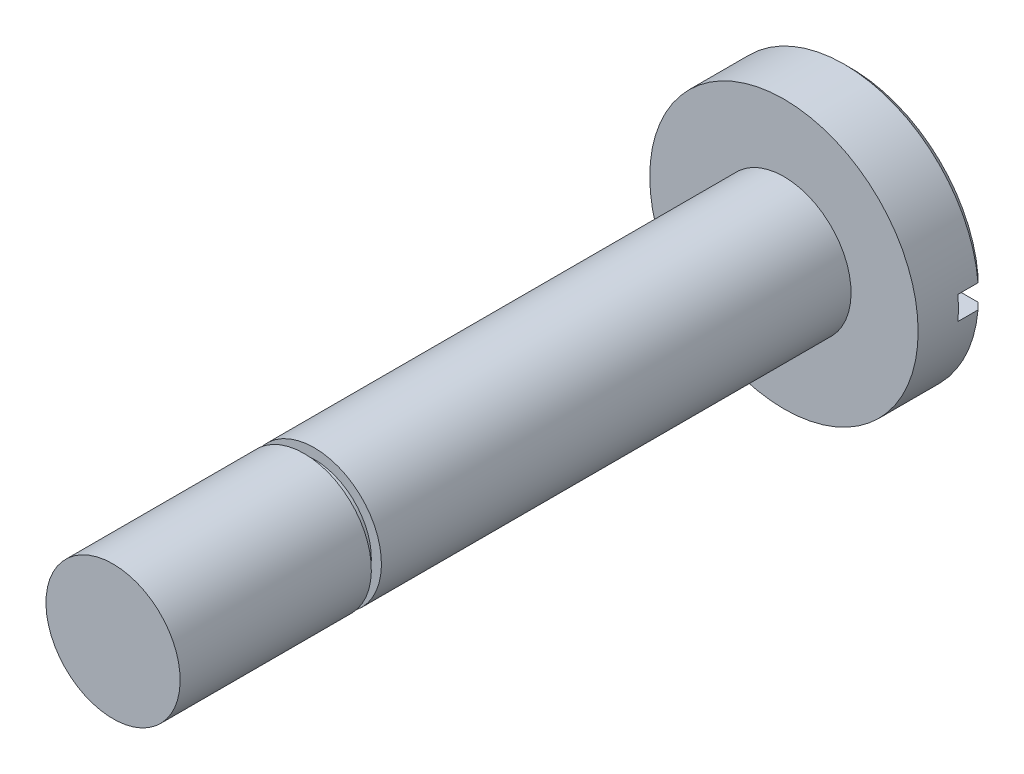
ISO-10303-21;
HEADER;
FILE_DESCRIPTION(('STEP AP214'),'2;1');
FILE_NAME('part.step','',(''),(''),'','','');
FILE_SCHEMA(('AUTOMOTIVE_DESIGN { 1 0 10303 214 1 1 1 1 }'));
ENDSEC;
DATA;
#1=APPLICATION_CONTEXT('core data for automotive mechanical design processes');
#2=APPLICATION_PROTOCOL_DEFINITION('international standard','automotive_design',2000,#1);
#3=PRODUCT_CONTEXT('',#1,'mechanical');
#4=PRODUCT('Part','Part','',(#3));
#5=PRODUCT_RELATED_PRODUCT_CATEGORY('part','',(#4));
#6=PRODUCT_DEFINITION_FORMATION('','',#4);
#7=PRODUCT_DEFINITION_CONTEXT('part definition',#1,'design');
#8=PRODUCT_DEFINITION('design','',#6,#7);
#9=PRODUCT_DEFINITION_SHAPE('','',#8);
#10=(LENGTH_UNIT() NAMED_UNIT(*) SI_UNIT(.MILLI.,.METRE.));
#11=(NAMED_UNIT(*) PLANE_ANGLE_UNIT() SI_UNIT($,.RADIAN.));
#12=(NAMED_UNIT(*) SI_UNIT($,.STERADIAN.) SOLID_ANGLE_UNIT());
#13=UNCERTAINTY_MEASURE_WITH_UNIT(LENGTH_MEASURE(1.E-05),#10,'distance_accuracy_value','');
#14=(GEOMETRIC_REPRESENTATION_CONTEXT(3) GLOBAL_UNCERTAINTY_ASSIGNED_CONTEXT((#13)) GLOBAL_UNIT_ASSIGNED_CONTEXT((#10,
#11,#12)) REPRESENTATION_CONTEXT('',''));
#15=CARTESIAN_POINT('',(0.,0.,0.));
#16=DIRECTION('',(0.,0.,1.));
#17=DIRECTION('',(1.,0.,0.));
#18=AXIS2_PLACEMENT_3D('',#15,#16,#17);
#19=CARTESIAN_POINT('',(0.,0.,0.));
#20=DIRECTION('',(0.,0.,-1.));
#21=DIRECTION('',(0.,-1.,0.));
#22=AXIS2_PLACEMENT_3D('',#19,#20,#21);
#23=PLANE('',#22);
#24=DIRECTION('',(1.,0.,0.));
#25=VECTOR('',#24,1.);
#26=CARTESIAN_POINT('',(0.,-0.35,0.));
#27=LINE('',#26,#25);
#28=CARTESIAN_POINT('',(-3.78384724850251,-0.35,0.));
#29=VERTEX_POINT('',#28);
#30=CARTESIAN_POINT('',(3.78384724850251,-0.35,0.));
#31=VERTEX_POINT('',#30);
#32=EDGE_CURVE('E193',#29,#31,#27,.T.);
#33=ORIENTED_EDGE('',*,*,#32,.T.);
#34=CARTESIAN_POINT('',(0.,0.,0.));
#35=DIRECTION('',(0.,0.,1.));
#36=DIRECTION('',(0.,-1.,0.));
#37=AXIS2_PLACEMENT_3D('',#34,#35,#36);
#38=CIRCLE('',#37,3.8);
#39=EDGE_CURVE('E11',#29,#31,#38,.T.);
#40=ORIENTED_EDGE('',*,*,#39,.F.);
#41=EDGE_LOOP('',(#33,#40));
#42=FACE_BOUND('',#41,.T.);
#43=ADVANCED_FACE('F39',(#42),#23,.T.);
#44=DIRECTION('',(-1.,0.,0.));
#45=VECTOR('',#44,1.);
#46=CARTESIAN_POINT('',(0.,0.35,0.));
#47=LINE('',#46,#45);
#48=CARTESIAN_POINT('',(3.78384724850251,0.35,0.));
#49=VERTEX_POINT('',#48);
#50=CARTESIAN_POINT('',(-3.78384724850251,0.35,0.));
#51=VERTEX_POINT('',#50);
#52=EDGE_CURVE('E195',#49,#51,#47,.T.);
#53=ORIENTED_EDGE('',*,*,#52,.T.);
#54=CARTESIAN_POINT('',(0.,0.,0.));
#55=DIRECTION('',(0.,0.,1.));
#56=DIRECTION('',(0.,-1.,0.));
#57=AXIS2_PLACEMENT_3D('',#54,#55,#56);
#58=CIRCLE('',#57,3.8);
#59=EDGE_CURVE('E221',#49,#51,#58,.T.);
#60=ORIENTED_EDGE('',*,*,#59,.F.);
#61=EDGE_LOOP('',(#53,#60));
#62=FACE_BOUND('',#61,.T.);
#63=ADVANCED_FACE('F149',(#62),#23,.T.);
#64=CARTESIAN_POINT('',(0.,0.,22.));
#65=DIRECTION('',(0.,0.,1.));
#66=DIRECTION('',(0.,1.,0.));
#67=AXIS2_PLACEMENT_3D('',#64,#65,#66);
#68=CYLINDRICAL_SURFACE('',#67,4.);
#69=DIRECTION('',(0.,0.,1.));
#70=VECTOR('',#69,1.);
#71=CARTESIAN_POINT('',(-3.98465807817936,0.350000000000003,22.));
#72=LINE('',#71,#70);
#73=CARTESIAN_POINT('',(-3.98465807817936,0.349999999999999,0.200000000000002));
#74=VERTEX_POINT('',#73);
#75=CARTESIAN_POINT('',(-3.98465807817936,0.35,0.8));
#76=VERTEX_POINT('',#75);
#77=EDGE_CURVE('E96',#74,#76,#72,.T.);
#78=ORIENTED_EDGE('',*,*,#77,.T.);
#79=CARTESIAN_POINT('',(0.,0.,0.799999999999999));
#80=DIRECTION('',(0.,0.,-1.));
#81=DIRECTION('',(-1.,0.,0.));
#82=AXIS2_PLACEMENT_3D('',#79,#80,#81);
#83=CIRCLE('',#82,4.);
#84=CARTESIAN_POINT('',(-3.98465807817936,-0.35,0.8));
#85=VERTEX_POINT('',#84);
#86=EDGE_CURVE('E105',#76,#85,#83,.F.);
#87=ORIENTED_EDGE('',*,*,#86,.T.);
#88=DIRECTION('',(0.,0.,1.));
#89=VECTOR('',#88,1.);
#90=CARTESIAN_POINT('',(-3.98465807817936,-0.350000000000003,22.));
#91=LINE('',#90,#89);
#92=CARTESIAN_POINT('',(-3.98465807817936,-0.350000000000007,0.200000000000002));
#93=VERTEX_POINT('',#92);
#94=EDGE_CURVE('E120',#85,#93,#91,.F.);
#95=ORIENTED_EDGE('',*,*,#94,.T.);
#96=CARTESIAN_POINT('',(0.,0.,0.200000000000002));
#97=DIRECTION('',(0.,0.,1.));
#98=DIRECTION('',(0.,-1.,0.));
#99=AXIS2_PLACEMENT_3D('',#96,#97,#98);
#100=CIRCLE('',#99,4.);
#101=CARTESIAN_POINT('',(3.98465807817936,-0.350000000000007,0.200000000000002));
#102=VERTEX_POINT('',#101);
#103=EDGE_CURVE('E125',#102,#93,#100,.F.);
#104=ORIENTED_EDGE('',*,*,#103,.F.);
#105=DIRECTION('',(0.,0.,1.));
#106=VECTOR('',#105,1.);
#107=CARTESIAN_POINT('',(3.98465807817936,-0.350000000000003,22.));
#108=LINE('',#107,#106);
#109=CARTESIAN_POINT('',(3.98465807817936,-0.35,0.8));
#110=VERTEX_POINT('',#109);
#111=EDGE_CURVE('E117',#102,#110,#108,.T.);
#112=ORIENTED_EDGE('',*,*,#111,.T.);
#113=CARTESIAN_POINT('',(3.98465807817936,0.35,0.8));
#114=VERTEX_POINT('',#113);
#115=EDGE_CURVE('E111',#110,#114,#83,.F.);
#116=ORIENTED_EDGE('',*,*,#115,.T.);
#117=DIRECTION('',(0.,0.,1.));
#118=VECTOR('',#117,1.);
#119=CARTESIAN_POINT('',(3.98465807817936,0.350000000000003,22.));
#120=LINE('',#119,#118);
#121=CARTESIAN_POINT('',(3.98465807817936,0.349999999999999,0.200000000000002));
#122=VERTEX_POINT('',#121);
#123=EDGE_CURVE('E98',#114,#122,#120,.F.);
#124=ORIENTED_EDGE('',*,*,#123,.T.);
#125=CARTESIAN_POINT('',(0.,0.,0.200000000000002));
#126=DIRECTION('',(0.,0.,1.));
#127=DIRECTION('',(0.,-1.,0.));
#128=AXIS2_PLACEMENT_3D('',#125,#126,#127);
#129=CIRCLE('',#128,4.);
#130=EDGE_CURVE('E116',#74,#122,#129,.F.);
#131=ORIENTED_EDGE('',*,*,#130,.F.);
#132=EDGE_LOOP('',(#78,#87,#95,#104,#112,#116,#124,#131));
#133=FACE_BOUND('',#132,.T.);
#134=CARTESIAN_POINT('',(0.,0.,2.));
#135=DIRECTION('',(0.,0.,-1.));
#136=DIRECTION('',(0.,1.,0.));
#137=AXIS2_PLACEMENT_3D('',#134,#135,#136);
#138=CIRCLE('',#137,4.);
#139=CARTESIAN_POINT('',(0.,4.,2.));
#140=VERTEX_POINT('',#139);
#141=EDGE_CURVE('E217',#140,#140,#138,.T.);
#142=ORIENTED_EDGE('',*,*,#141,.T.);
#143=EDGE_LOOP('',(#142));
#144=FACE_BOUND('',#143,.T.);
#145=ADVANCED_FACE('F113',(#133,#144),#68,.T.);
#146=CARTESIAN_POINT('',(0.,4.,2.));
#147=DIRECTION('',(0.,0.,1.));
#148=DIRECTION('',(0.,1.,0.));
#149=AXIS2_PLACEMENT_3D('',#146,#147,#148);
#150=PLANE('',#149);
#151=ORIENTED_EDGE('',*,*,#141,.F.);
#152=EDGE_LOOP('',(#151));
#153=FACE_BOUND('',#152,.T.);
#154=CARTESIAN_POINT('',(0.,0.,2.));
#155=DIRECTION('',(0.,0.,-1.));
#156=DIRECTION('',(0.,1.,0.));
#157=AXIS2_PLACEMENT_3D('',#154,#155,#156);
#158=CIRCLE('',#157,2.);
#159=CARTESIAN_POINT('',(0.,2.,2.));
#160=VERTEX_POINT('',#159);
#161=EDGE_CURVE('E214',#160,#160,#158,.T.);
#162=ORIENTED_EDGE('',*,*,#161,.T.);
#163=EDGE_LOOP('',(#162));
#164=FACE_BOUND('',#163,.T.);
#165=ADVANCED_FACE('F156',(#153,#164),#150,.T.);
#166=CARTESIAN_POINT('',(0.,0.,22.));
#167=DIRECTION('',(0.,0.,1.));
#168=DIRECTION('',(0.,1.,0.));
#169=AXIS2_PLACEMENT_3D('',#166,#167,#168);
#170=CYLINDRICAL_SURFACE('',#169,2.);
#171=ORIENTED_EDGE('',*,*,#161,.F.);
#172=EDGE_LOOP('',(#171));
#173=FACE_BOUND('',#172,.T.);
#174=CARTESIAN_POINT('',(0.,0.,16.));
#175=DIRECTION('',(0.,0.,-1.));
#176=DIRECTION('',(0.,1.,0.));
#177=AXIS2_PLACEMENT_3D('',#174,#175,#176);
#178=CIRCLE('',#177,2.);
#179=CARTESIAN_POINT('',(0.,2.,16.));
#180=VERTEX_POINT('',#179);
#181=EDGE_CURVE('E211',#180,#180,#178,.T.);
#182=ORIENTED_EDGE('',*,*,#181,.T.);
#183=EDGE_LOOP('',(#182));
#184=FACE_BOUND('',#183,.T.);
#185=ADVANCED_FACE('F159',(#173,#184),#170,.T.);
#186=CARTESIAN_POINT('',(0.,2.,16.));
#187=DIRECTION('',(0.,0.,1.));
#188=DIRECTION('',(0.,1.,0.));
#189=AXIS2_PLACEMENT_3D('',#186,#187,#188);
#190=PLANE('',#189);
#191=ORIENTED_EDGE('',*,*,#181,.F.);
#192=EDGE_LOOP('',(#191));
#193=FACE_BOUND('',#192,.T.);
#194=CARTESIAN_POINT('',(0.,0.,16.));
#195=DIRECTION('',(0.,0.,-1.));
#196=DIRECTION('',(0.,1.,0.));
#197=AXIS2_PLACEMENT_3D('',#194,#195,#196);
#198=CIRCLE('',#197,1.7);
#199=CARTESIAN_POINT('',(0.,1.7,16.));
#200=VERTEX_POINT('',#199);
#201=EDGE_CURVE('E208',#200,#200,#198,.T.);
#202=ORIENTED_EDGE('',*,*,#201,.T.);
#203=EDGE_LOOP('',(#202));
#204=FACE_BOUND('',#203,.T.);
#205=ADVANCED_FACE('F163',(#193,#204),#190,.T.);
#206=CARTESIAN_POINT('',(0.,0.,22.));
#207=DIRECTION('',(0.,0.,1.));
#208=DIRECTION('',(0.,1.,0.));
#209=AXIS2_PLACEMENT_3D('',#206,#207,#208);
#210=CYLINDRICAL_SURFACE('',#209,1.7);
#211=ORIENTED_EDGE('',*,*,#201,.F.);
#212=EDGE_LOOP('',(#211));
#213=FACE_BOUND('',#212,.T.);
#214=CARTESIAN_POINT('',(0.,0.,16.3));
#215=DIRECTION('',(0.,0.,-1.));
#216=DIRECTION('',(0.,1.,0.));
#217=AXIS2_PLACEMENT_3D('',#214,#215,#216);
#218=CIRCLE('',#217,1.7);
#219=CARTESIAN_POINT('',(0.,1.7,16.3));
#220=VERTEX_POINT('',#219);
#221=EDGE_CURVE('E205',#220,#220,#218,.T.);
#222=ORIENTED_EDGE('',*,*,#221,.T.);
#223=EDGE_LOOP('',(#222));
#224=FACE_BOUND('',#223,.T.);
#225=ADVANCED_FACE('F167',(#213,#224),#210,.T.);
#226=CARTESIAN_POINT('',(0.,1.7,16.3));
#227=DIRECTION('',(0.,0.,-1.));
#228=DIRECTION('',(0.,-1.,0.));
#229=AXIS2_PLACEMENT_3D('',#226,#227,#228);
#230=PLANE('',#229);
#231=ORIENTED_EDGE('',*,*,#221,.F.);
#232=EDGE_LOOP('',(#231));
#233=FACE_BOUND('',#232,.T.);
#234=CARTESIAN_POINT('',(0.,0.,16.3));
#235=DIRECTION('',(0.,0.,-1.));
#236=DIRECTION('',(0.,1.,0.));
#237=AXIS2_PLACEMENT_3D('',#234,#235,#236);
#238=CIRCLE('',#237,2.);
#239=CARTESIAN_POINT('',(0.,2.,16.3));
#240=VERTEX_POINT('',#239);
#241=EDGE_CURVE('E198',#240,#240,#238,.T.);
#242=ORIENTED_EDGE('',*,*,#241,.T.);
#243=EDGE_LOOP('',(#242));
#244=FACE_BOUND('',#243,.T.);
#245=ADVANCED_FACE('F171',(#233,#244),#230,.T.);
#246=CARTESIAN_POINT('',(0.,0.,22.));
#247=DIRECTION('',(0.,0.,1.));
#248=DIRECTION('',(0.,1.,0.));
#249=AXIS2_PLACEMENT_3D('',#246,#247,#248);
#250=CYLINDRICAL_SURFACE('',#249,2.);
#251=ORIENTED_EDGE('',*,*,#241,.F.);
#252=EDGE_LOOP('',(#251));
#253=FACE_BOUND('',#252,.T.);
#254=CARTESIAN_POINT('',(0.,0.,22.));
#255=DIRECTION('',(0.,0.,-1.));
#256=DIRECTION('',(0.,1.,0.));
#257=AXIS2_PLACEMENT_3D('',#254,#255,#256);
#258=CIRCLE('',#257,2.);
#259=CARTESIAN_POINT('',(0.,2.,22.));
#260=VERTEX_POINT('',#259);
#261=EDGE_CURVE('E194',#260,#260,#258,.T.);
#262=ORIENTED_EDGE('',*,*,#261,.T.);
#263=EDGE_LOOP('',(#262));
#264=FACE_BOUND('',#263,.T.);
#265=ADVANCED_FACE('F175',(#253,#264),#250,.T.);
#266=CARTESIAN_POINT('',(0.,2.,22.));
#267=DIRECTION('',(0.,0.,1.));
#268=DIRECTION('',(0.,1.,0.));
#269=AXIS2_PLACEMENT_3D('',#266,#267,#268);
#270=PLANE('',#269);
#271=ORIENTED_EDGE('',*,*,#261,.F.);
#272=EDGE_LOOP('',(#271));
#273=FACE_BOUND('',#272,.T.);
#274=ADVANCED_FACE('F179',(#273),#270,.T.);
#275=CARTESIAN_POINT('',(-4.,-0.35,0.8));
#276=DIRECTION('',(0.,0.,1.));
#277=DIRECTION('',(-1.,0.,0.));
#278=AXIS2_PLACEMENT_3D('',#275,#276,#277);
#279=PLANE('',#278);
#280=DIRECTION('',(1.,0.,0.));
#281=VECTOR('',#280,1.);
#282=CARTESIAN_POINT('',(-4.,-0.35,0.8));
#283=LINE('',#282,#281);
#284=EDGE_CURVE('E102',#85,#110,#283,.T.);
#285=ORIENTED_EDGE('',*,*,#284,.F.);
#286=ORIENTED_EDGE('',*,*,#86,.F.);
#287=DIRECTION('',(1.,0.,0.));
#288=VECTOR('',#287,1.);
#289=CARTESIAN_POINT('',(-4.,0.35,0.8));
#290=LINE('',#289,#288);
#291=EDGE_CURVE('E92',#76,#114,#290,.T.);
#292=ORIENTED_EDGE('',*,*,#291,.T.);
#293=ORIENTED_EDGE('',*,*,#115,.F.);
#294=EDGE_LOOP('',(#285,#286,#292,#293));
#295=FACE_BOUND('',#294,.T.);
#296=ADVANCED_FACE('F106',(#295),#279,.F.);
#297=CARTESIAN_POINT('',(-4.,-0.35,-0.8));
#298=DIRECTION('',(0.,-1.,0.));
#299=DIRECTION('',(0.,0.,1.));
#300=AXIS2_PLACEMENT_3D('',#297,#298,#299);
#301=PLANE('',#300);
#302=ORIENTED_EDGE('',*,*,#94,.F.);
#303=ORIENTED_EDGE('',*,*,#284,.T.);
#304=ORIENTED_EDGE('',*,*,#111,.F.);
#305=CARTESIAN_POINT('',(3.78384724850251,-0.35,0.));
#306=CARTESIAN_POINT('',(3.81731919219732,-0.35,0.0333298471796536));
#307=CARTESIAN_POINT('',(3.85078939985229,-0.35,0.0666614374373066));
#308=CARTESIAN_POINT('',(3.9177263430779,-0.35,0.133328104103974));
#309=CARTESIAN_POINT('',(3.95119307864855,-0.35,0.166663180512989));
#310=CARTESIAN_POINT('',(3.98465807817936,-0.35,0.200000000000002));
#311=B_SPLINE_CURVE_WITH_KNOTS('',3,(#305,#306,#307,#308,#309,#310),.UNSPECIFIED.,.F.,.F.,(4,2,
4),(0.,0.141708317985003,0.283416635950295),.UNSPECIFIED.);
#312=EDGE_CURVE('E55',#31,#102,#311,.T.);
#313=ORIENTED_EDGE('',*,*,#312,.F.);
#314=ORIENTED_EDGE('',*,*,#32,.F.);
#315=CARTESIAN_POINT('',(-3.98465807817936,-0.350000000000007,0.200000000000002));
#316=CARTESIAN_POINT('',(-3.95119307864855,-0.350000000000003,0.166663180512989));
#317=CARTESIAN_POINT('',(-3.9177263430779,-0.350000000000001,0.133328104103975));
#318=CARTESIAN_POINT('',(-3.85078939985229,-0.349999999999999,0.0666614374373068));
#319=CARTESIAN_POINT('',(-3.81731919219732,-0.349999999999999,0.0333298471796538));
#320=CARTESIAN_POINT('',(-3.78384724850251,-0.35,0.));
#321=B_SPLINE_CURVE_WITH_KNOTS('',3,(#315,#316,#317,#318,#319,#320),.UNSPECIFIED.,.F.,.F.,(4,2,
4),(0.,0.141708317965292,0.283416635950295),.UNSPECIFIED.);
#322=EDGE_CURVE('E48',#93,#29,#321,.T.);
#323=ORIENTED_EDGE('',*,*,#322,.F.);
#324=EDGE_LOOP('',(#302,#303,#304,#313,#314,#323));
#325=FACE_BOUND('',#324,.T.);
#326=ADVANCED_FACE('F184',(#325),#301,.F.);
#327=CARTESIAN_POINT('',(-4.,0.35,-0.8));
#328=DIRECTION('',(0.,1.,0.));
#329=DIRECTION('',(0.,0.,-1.));
#330=AXIS2_PLACEMENT_3D('',#327,#328,#329);
#331=PLANE('',#330);
#332=ORIENTED_EDGE('',*,*,#123,.F.);
#333=ORIENTED_EDGE('',*,*,#291,.F.);
#334=ORIENTED_EDGE('',*,*,#77,.F.);
#335=CARTESIAN_POINT('',(-3.78384724850251,0.35,0.));
#336=CARTESIAN_POINT('',(-3.81731919219732,0.35,0.0333298471796534));
#337=CARTESIAN_POINT('',(-3.85078939985229,0.35,0.0666614374373064));
#338=CARTESIAN_POINT('',(-3.9177263430779,0.35,0.133328104103975));
#339=CARTESIAN_POINT('',(-3.95119307864855,0.35,0.166663180512989));
#340=CARTESIAN_POINT('',(-3.98465807817936,0.35,0.200000000000003));
#341=B_SPLINE_CURVE_WITH_KNOTS('',3,(#335,#336,#337,#338,#339,#340),.UNSPECIFIED.,.F.,.F.,(4,2,
4),(0.,0.141708317985005,0.283416635950298),.UNSPECIFIED.);
#342=EDGE_CURVE('E128',#51,#74,#341,.T.);
#343=ORIENTED_EDGE('',*,*,#342,.F.);
#344=ORIENTED_EDGE('',*,*,#52,.F.);
#345=CARTESIAN_POINT('',(3.98465807817936,0.349999999999999,0.200000000000002));
#346=CARTESIAN_POINT('',(3.95119307864855,0.35,0.166663180512989));
#347=CARTESIAN_POINT('',(3.9177263430779,0.35,0.133328104103975));
#348=CARTESIAN_POINT('',(3.85078939985229,0.35,0.0666614374373067));
#349=CARTESIAN_POINT('',(3.81731919219732,0.35,0.0333298471796536));
#350=CARTESIAN_POINT('',(3.78384724850251,0.35,0.));
#351=B_SPLINE_CURVE_WITH_KNOTS('',3,(#345,#346,#347,#348,#349,#350),.UNSPECIFIED.,.F.,.F.,(4,2,
4),(0.,0.141708317965293,0.283416635950298),.UNSPECIFIED.);
#352=EDGE_CURVE('E135',#122,#49,#351,.T.);
#353=ORIENTED_EDGE('',*,*,#352,.F.);
#354=EDGE_LOOP('',(#332,#333,#334,#343,#344,#353));
#355=FACE_BOUND('',#354,.T.);
#356=ADVANCED_FACE('F94',(#355),#331,.F.);
#357=CARTESIAN_POINT('',(0.,0.,0.200000000000002));
#358=DIRECTION('',(0.,0.,1.));
#359=DIRECTION('',(0.,1.,0.));
#360=AXIS2_PLACEMENT_3D('',#357,#358,#359);
#361=CONICAL_SURFACE('',#360,4.,0.785398163397448);
#362=ORIENTED_EDGE('',*,*,#342,.T.);
#363=ORIENTED_EDGE('',*,*,#130,.T.);
#364=ORIENTED_EDGE('',*,*,#352,.T.);
#365=ORIENTED_EDGE('',*,*,#59,.T.);
#366=EDGE_LOOP('',(#362,#363,#364,#365));
#367=FACE_BOUND('',#366,.T.);
#368=ADVANCED_FACE('F144',(#367),#361,.T.);
#369=CARTESIAN_POINT('',(0.,0.,0.200000000000002));
#370=DIRECTION('',(0.,0.,1.));
#371=DIRECTION('',(0.,1.,0.));
#372=AXIS2_PLACEMENT_3D('',#369,#370,#371);
#373=CONICAL_SURFACE('',#372,4.,0.785398163397442);
#374=ORIENTED_EDGE('',*,*,#312,.T.);
#375=ORIENTED_EDGE('',*,*,#103,.T.);
#376=ORIENTED_EDGE('',*,*,#322,.T.);
#377=ORIENTED_EDGE('',*,*,#39,.T.);
#378=EDGE_LOOP('',(#374,#375,#376,#377));
#379=FACE_BOUND('',#378,.T.);
#380=ADVANCED_FACE('F41',(#379),#373,.T.);
#381=CLOSED_SHELL('',(#43,#63,#145,#165,#185,#205,#225,#245,#265,#274,#296,#326,#356,#368,#380));
#382=MANIFOLD_SOLID_BREP('B2',#381);
#383=ADVANCED_BREP_SHAPE_REPRESENTATION('',(#18,#382),#14);
#384=SHAPE_DEFINITION_REPRESENTATION(#9,#383);
ENDSEC;
END-ISO-10303-21;
